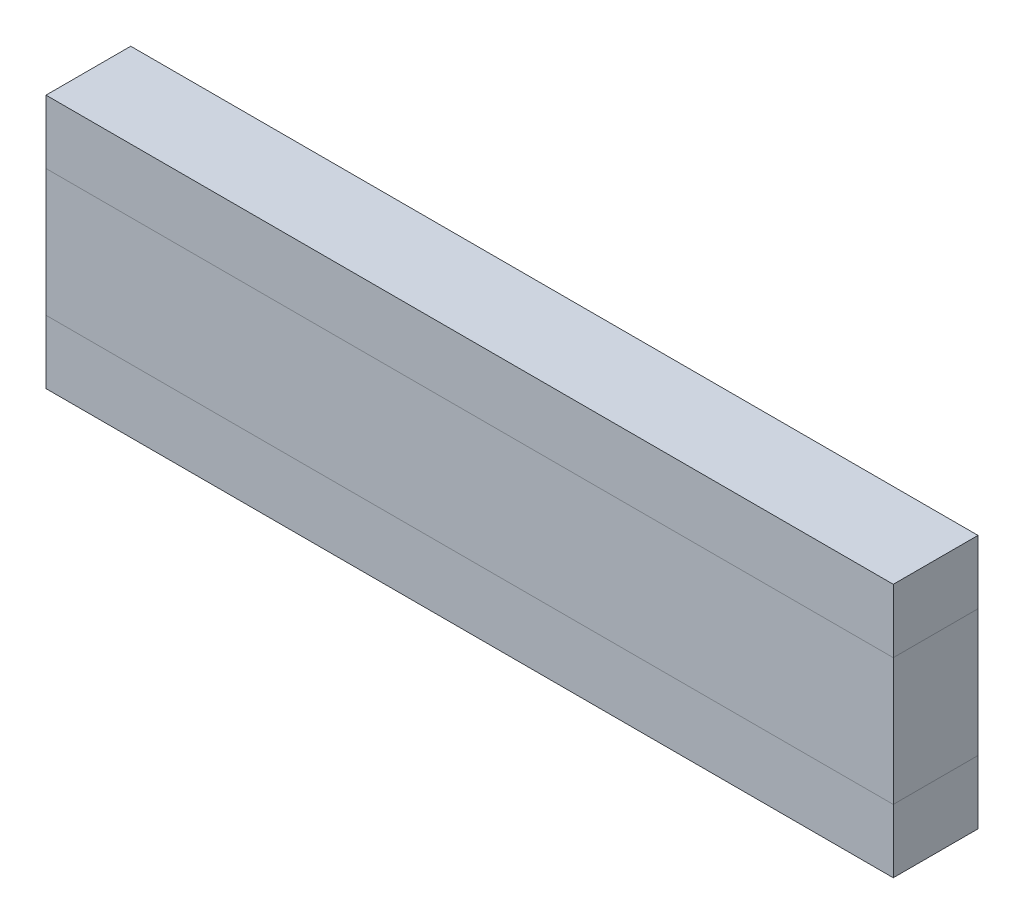
ISO-10303-21;
HEADER;
FILE_DESCRIPTION(('STEP AP214'),'2;1');
FILE_NAME('part.step','',(''),(''),'','','');
FILE_SCHEMA(('AUTOMOTIVE_DESIGN { 1 0 10303 214 1 1 1 1 }'));
ENDSEC;
DATA;
#1=APPLICATION_CONTEXT('core data for automotive mechanical design processes');
#2=APPLICATION_PROTOCOL_DEFINITION('international standard','automotive_design',2000,#1);
#3=PRODUCT_CONTEXT('',#1,'mechanical');
#4=PRODUCT('Part','Part','',(#3));
#5=PRODUCT_RELATED_PRODUCT_CATEGORY('part','',(#4));
#6=PRODUCT_DEFINITION_FORMATION('','',#4);
#7=PRODUCT_DEFINITION_CONTEXT('part definition',#1,'design');
#8=PRODUCT_DEFINITION('design','',#6,#7);
#9=PRODUCT_DEFINITION_SHAPE('','',#8);
#10=(LENGTH_UNIT() NAMED_UNIT(*) SI_UNIT(.MILLI.,.METRE.));
#11=(NAMED_UNIT(*) PLANE_ANGLE_UNIT() SI_UNIT($,.RADIAN.));
#12=(NAMED_UNIT(*) SI_UNIT($,.STERADIAN.) SOLID_ANGLE_UNIT());
#13=UNCERTAINTY_MEASURE_WITH_UNIT(LENGTH_MEASURE(1.E-05),#10,'distance_accuracy_value','');
#14=(GEOMETRIC_REPRESENTATION_CONTEXT(3) GLOBAL_UNCERTAINTY_ASSIGNED_CONTEXT((#13)) GLOBAL_UNIT_ASSIGNED_CONTEXT((#10,
#11,#12)) REPRESENTATION_CONTEXT('',''));
#15=CARTESIAN_POINT('',(0.,0.,0.));
#16=DIRECTION('',(0.,0.,1.));
#17=DIRECTION('',(1.,0.,0.));
#18=AXIS2_PLACEMENT_3D('',#15,#16,#17);
#19=CARTESIAN_POINT('',(-49.9999999999999,-7.49999999999999,105.280855600658));
#20=DIRECTION('',(1.,0.,0.));
#21=DIRECTION('',(0.,0.,-1.));
#22=AXIS2_PLACEMENT_3D('',#19,#20,#21);
#23=PLANE('',#22);
#24=DIRECTION('',(0.,-1.,0.));
#25=VECTOR('',#24,1.);
#26=CARTESIAN_POINT('',(-49.9999999999999,-7.49999999999999,5.));
#27=LINE('',#26,#25);
#28=CARTESIAN_POINT('',(-49.9999999999999,-7.49999999999999,5.));
#29=VERTEX_POINT('',#28);
#30=CARTESIAN_POINT('',(-49.9999999999999,-15.,5.));
#31=VERTEX_POINT('',#30);
#32=EDGE_CURVE('E116',#29,#31,#27,.T.);
#33=ORIENTED_EDGE('',*,*,#32,.F.);
#34=DIRECTION('',(0.,0.,-1.));
#35=VECTOR('',#34,1.);
#36=CARTESIAN_POINT('',(-49.9999999999999,-7.49999999999999,105.280855600658));
#37=LINE('',#36,#35);
#38=CARTESIAN_POINT('',(-49.9999999999999,-7.49999999999999,-5.));
#39=VERTEX_POINT('',#38);
#40=EDGE_CURVE('E54',#29,#39,#37,.T.);
#41=ORIENTED_EDGE('',*,*,#40,.T.);
#42=DIRECTION('',(0.,1.,0.));
#43=VECTOR('',#42,1.);
#44=CARTESIAN_POINT('',(-49.9999999999999,-7.49999999999999,-5.));
#45=LINE('',#44,#43);
#46=CARTESIAN_POINT('',(-49.9999999999999,-15.,-5.));
#47=VERTEX_POINT('',#46);
#48=EDGE_CURVE('E110',#47,#39,#45,.T.);
#49=ORIENTED_EDGE('',*,*,#48,.F.);
#50=DIRECTION('',(0.,0.,-1.));
#51=VECTOR('',#50,1.);
#52=CARTESIAN_POINT('',(-49.9999999999999,-15.,105.280855600658));
#53=LINE('',#52,#51);
#54=EDGE_CURVE('E99',#31,#47,#53,.T.);
#55=ORIENTED_EDGE('',*,*,#54,.F.);
#56=EDGE_LOOP('',(#33,#41,#49,#55));
#57=FACE_BOUND('',#56,.T.);
#58=ADVANCED_FACE('F50',(#57),#23,.F.);
#59=CARTESIAN_POINT('',(-49.9999999999999,-15.,105.280855600658));
#60=DIRECTION('',(0.,1.,0.));
#61=DIRECTION('',(0.,0.,1.));
#62=AXIS2_PLACEMENT_3D('',#59,#60,#61);
#63=PLANE('',#62);
#64=DIRECTION('',(1.,0.,0.));
#65=VECTOR('',#64,1.);
#66=CARTESIAN_POINT('',(-49.9999999999999,-15.,5.));
#67=LINE('',#66,#65);
#68=CARTESIAN_POINT('',(50.,-15.,5.));
#69=VERTEX_POINT('',#68);
#70=EDGE_CURVE('E59',#31,#69,#67,.T.);
#71=ORIENTED_EDGE('',*,*,#70,.F.);
#72=ORIENTED_EDGE('',*,*,#54,.T.);
#73=DIRECTION('',(-1.,0.,0.));
#74=VECTOR('',#73,1.);
#75=CARTESIAN_POINT('',(-49.9999999999999,-15.,-5.));
#76=LINE('',#75,#74);
#77=CARTESIAN_POINT('',(50.,-15.,-5.));
#78=VERTEX_POINT('',#77);
#79=EDGE_CURVE('E105',#78,#47,#76,.T.);
#80=ORIENTED_EDGE('',*,*,#79,.F.);
#81=DIRECTION('',(0.,0.,-1.));
#82=VECTOR('',#81,1.);
#83=CARTESIAN_POINT('',(50.,-15.,105.280855600658));
#84=LINE('',#83,#82);
#85=EDGE_CURVE('E94',#69,#78,#84,.T.);
#86=ORIENTED_EDGE('',*,*,#85,.F.);
#87=EDGE_LOOP('',(#71,#72,#80,#86));
#88=FACE_BOUND('',#87,.T.);
#89=ADVANCED_FACE('F109',(#88),#63,.F.);
#90=CARTESIAN_POINT('',(50.,-7.49999999999999,105.280855600658));
#91=DIRECTION('',(-1.,0.,0.));
#92=DIRECTION('',(0.,0.,1.));
#93=AXIS2_PLACEMENT_3D('',#90,#91,#92);
#94=PLANE('',#93);
#95=DIRECTION('',(0.,1.,0.));
#96=VECTOR('',#95,1.);
#97=CARTESIAN_POINT('',(50.,-7.49999999999999,5.));
#98=LINE('',#97,#96);
#99=CARTESIAN_POINT('',(50.,-7.49999999999999,5.));
#100=VERTEX_POINT('',#99);
#101=EDGE_CURVE('E12',#69,#100,#98,.T.);
#102=ORIENTED_EDGE('',*,*,#101,.F.);
#103=ORIENTED_EDGE('',*,*,#85,.T.);
#104=DIRECTION('',(0.,-1.,0.));
#105=VECTOR('',#104,1.);
#106=CARTESIAN_POINT('',(50.,-7.49999999999999,-5.));
#107=LINE('',#106,#105);
#108=CARTESIAN_POINT('',(50.,-7.49999999999999,-5.));
#109=VERTEX_POINT('',#108);
#110=EDGE_CURVE('E97',#109,#78,#107,.T.);
#111=ORIENTED_EDGE('',*,*,#110,.F.);
#112=DIRECTION('',(0.,0.,-1.));
#113=VECTOR('',#112,1.);
#114=CARTESIAN_POINT('',(50.,-7.49999999999999,105.280855600658));
#115=LINE('',#114,#113);
#116=EDGE_CURVE('E75',#100,#109,#115,.T.);
#117=ORIENTED_EDGE('',*,*,#116,.F.);
#118=EDGE_LOOP('',(#102,#103,#111,#117));
#119=FACE_BOUND('',#118,.T.);
#120=ADVANCED_FACE('F96',(#119),#94,.F.);
#121=CARTESIAN_POINT('',(-49.9999999999999,-7.49999999999999,105.280855600658));
#122=DIRECTION('',(0.,-1.,0.));
#123=DIRECTION('',(0.,0.,-1.));
#124=AXIS2_PLACEMENT_3D('',#121,#122,#123);
#125=PLANE('',#124);
#126=DIRECTION('',(-1.,0.,0.));
#127=VECTOR('',#126,1.);
#128=CARTESIAN_POINT('',(-49.9999999999999,-7.49999999999999,5.));
#129=LINE('',#128,#127);
#130=EDGE_CURVE('E119',#100,#29,#129,.T.);
#131=ORIENTED_EDGE('',*,*,#130,.F.);
#132=ORIENTED_EDGE('',*,*,#116,.T.);
#133=DIRECTION('',(1.,0.,0.));
#134=VECTOR('',#133,1.);
#135=CARTESIAN_POINT('',(-49.9999999999999,-7.49999999999999,-5.));
#136=LINE('',#135,#134);
#137=EDGE_CURVE('E107',#39,#109,#136,.T.);
#138=ORIENTED_EDGE('',*,*,#137,.F.);
#139=ORIENTED_EDGE('',*,*,#40,.F.);
#140=EDGE_LOOP('',(#131,#132,#138,#139));
#141=FACE_BOUND('',#140,.T.);
#142=ADVANCED_FACE('F123',(#141),#125,.F.);
#143=CARTESIAN_POINT('',(0.,0.,5.));
#144=DIRECTION('',(0.,0.,1.));
#145=DIRECTION('',(1.,0.,0.));
#146=AXIS2_PLACEMENT_3D('',#143,#144,#145);
#147=PLANE('',#146);
#148=ORIENTED_EDGE('',*,*,#130,.T.);
#149=ORIENTED_EDGE('',*,*,#32,.T.);
#150=ORIENTED_EDGE('',*,*,#70,.T.);
#151=ORIENTED_EDGE('',*,*,#101,.T.);
#152=EDGE_LOOP('',(#148,#149,#150,#151));
#153=FACE_BOUND('',#152,.T.);
#154=ADVANCED_FACE('F52',(#153),#147,.T.);
#155=CARTESIAN_POINT('',(0.,0.,-5.));
#156=DIRECTION('',(0.,0.,1.));
#157=DIRECTION('',(1.,0.,0.));
#158=AXIS2_PLACEMENT_3D('',#155,#156,#157);
#159=PLANE('',#158);
#160=ORIENTED_EDGE('',*,*,#48,.T.);
#161=ORIENTED_EDGE('',*,*,#137,.T.);
#162=ORIENTED_EDGE('',*,*,#110,.T.);
#163=ORIENTED_EDGE('',*,*,#79,.T.);
#164=EDGE_LOOP('',(#160,#161,#162,#163));
#165=FACE_BOUND('',#164,.T.);
#166=ADVANCED_FACE('F104',(#165),#159,.F.);
#167=CLOSED_SHELL('',(#58,#89,#120,#142,#154,#166));
#168=MANIFOLD_SOLID_BREP('B2',#167);
#169=CARTESIAN_POINT('',(-49.9999999999999,7.50000000000001,105.280855600658));
#170=DIRECTION('',(1.,0.,0.));
#171=DIRECTION('',(0.,0.,-1.));
#172=AXIS2_PLACEMENT_3D('',#169,#170,#171);
#173=PLANE('',#172);
#174=DIRECTION('',(0.,-1.,0.));
#175=VECTOR('',#174,1.);
#176=CARTESIAN_POINT('',(-49.9999999999999,7.50000000000001,5.));
#177=LINE('',#176,#175);
#178=CARTESIAN_POINT('',(-49.9999999999999,15.,5.));
#179=VERTEX_POINT('',#178);
#180=CARTESIAN_POINT('',(-49.9999999999999,7.50000000000001,5.));
#181=VERTEX_POINT('',#180);
#182=EDGE_CURVE('E249',#179,#181,#177,.T.);
#183=ORIENTED_EDGE('',*,*,#182,.F.);
#184=DIRECTION('',(0.,0.,-1.));
#185=VECTOR('',#184,1.);
#186=CARTESIAN_POINT('',(-49.9999999999999,15.,105.280855600658));
#187=LINE('',#186,#185);
#188=CARTESIAN_POINT('',(-49.9999999999999,15.,-5.));
#189=VERTEX_POINT('',#188);
#190=EDGE_CURVE('E187',#179,#189,#187,.T.);
#191=ORIENTED_EDGE('',*,*,#190,.T.);
#192=DIRECTION('',(0.,1.,0.));
#193=VECTOR('',#192,1.);
#194=CARTESIAN_POINT('',(-49.9999999999999,7.50000000000001,-5.));
#195=LINE('',#194,#193);
#196=CARTESIAN_POINT('',(-49.9999999999999,7.50000000000001,-5.));
#197=VERTEX_POINT('',#196);
#198=EDGE_CURVE('E243',#197,#189,#195,.T.);
#199=ORIENTED_EDGE('',*,*,#198,.F.);
#200=DIRECTION('',(0.,0.,-1.));
#201=VECTOR('',#200,1.);
#202=CARTESIAN_POINT('',(-49.9999999999999,7.50000000000001,105.280855600658));
#203=LINE('',#202,#201);
#204=EDGE_CURVE('E232',#181,#197,#203,.T.);
#205=ORIENTED_EDGE('',*,*,#204,.F.);
#206=EDGE_LOOP('',(#183,#191,#199,#205));
#207=FACE_BOUND('',#206,.T.);
#208=ADVANCED_FACE('F183',(#207),#173,.F.);
#209=CARTESIAN_POINT('',(-49.9999999999999,7.50000000000001,105.280855600658));
#210=DIRECTION('',(0.,1.,0.));
#211=DIRECTION('',(0.,0.,1.));
#212=AXIS2_PLACEMENT_3D('',#209,#210,#211);
#213=PLANE('',#212);
#214=DIRECTION('',(1.,0.,0.));
#215=VECTOR('',#214,1.);
#216=CARTESIAN_POINT('',(-49.9999999999999,7.50000000000001,5.));
#217=LINE('',#216,#215);
#218=CARTESIAN_POINT('',(50.,7.50000000000001,5.));
#219=VERTEX_POINT('',#218);
#220=EDGE_CURVE('E192',#181,#219,#217,.T.);
#221=ORIENTED_EDGE('',*,*,#220,.F.);
#222=ORIENTED_EDGE('',*,*,#204,.T.);
#223=DIRECTION('',(-1.,0.,0.));
#224=VECTOR('',#223,1.);
#225=CARTESIAN_POINT('',(-49.9999999999999,7.50000000000001,-5.));
#226=LINE('',#225,#224);
#227=CARTESIAN_POINT('',(50.,7.50000000000001,-5.));
#228=VERTEX_POINT('',#227);
#229=EDGE_CURVE('E238',#228,#197,#226,.T.);
#230=ORIENTED_EDGE('',*,*,#229,.F.);
#231=DIRECTION('',(0.,0.,-1.));
#232=VECTOR('',#231,1.);
#233=CARTESIAN_POINT('',(50.,7.50000000000001,105.280855600658));
#234=LINE('',#233,#232);
#235=EDGE_CURVE('E227',#219,#228,#234,.T.);
#236=ORIENTED_EDGE('',*,*,#235,.F.);
#237=EDGE_LOOP('',(#221,#222,#230,#236));
#238=FACE_BOUND('',#237,.T.);
#239=ADVANCED_FACE('F242',(#238),#213,.F.);
#240=CARTESIAN_POINT('',(50.,7.50000000000001,105.280855600658));
#241=DIRECTION('',(-1.,0.,0.));
#242=DIRECTION('',(0.,0.,1.));
#243=AXIS2_PLACEMENT_3D('',#240,#241,#242);
#244=PLANE('',#243);
#245=DIRECTION('',(0.,1.,0.));
#246=VECTOR('',#245,1.);
#247=CARTESIAN_POINT('',(50.,7.50000000000001,5.));
#248=LINE('',#247,#246);
#249=CARTESIAN_POINT('',(50.,15.,5.));
#250=VERTEX_POINT('',#249);
#251=EDGE_CURVE('E48',#219,#250,#248,.T.);
#252=ORIENTED_EDGE('',*,*,#251,.F.);
#253=ORIENTED_EDGE('',*,*,#235,.T.);
#254=DIRECTION('',(0.,-1.,0.));
#255=VECTOR('',#254,1.);
#256=CARTESIAN_POINT('',(50.,7.50000000000001,-5.));
#257=LINE('',#256,#255);
#258=CARTESIAN_POINT('',(50.,15.,-5.));
#259=VERTEX_POINT('',#258);
#260=EDGE_CURVE('E230',#259,#228,#257,.T.);
#261=ORIENTED_EDGE('',*,*,#260,.F.);
#262=DIRECTION('',(0.,0.,-1.));
#263=VECTOR('',#262,1.);
#264=CARTESIAN_POINT('',(50.,15.,105.280855600658));
#265=LINE('',#264,#263);
#266=EDGE_CURVE('E208',#250,#259,#265,.T.);
#267=ORIENTED_EDGE('',*,*,#266,.F.);
#268=EDGE_LOOP('',(#252,#253,#261,#267));
#269=FACE_BOUND('',#268,.T.);
#270=ADVANCED_FACE('F229',(#269),#244,.F.);
#271=CARTESIAN_POINT('',(-49.9999999999999,15.,105.280855600658));
#272=DIRECTION('',(0.,-1.,0.));
#273=DIRECTION('',(0.,0.,-1.));
#274=AXIS2_PLACEMENT_3D('',#271,#272,#273);
#275=PLANE('',#274);
#276=DIRECTION('',(-1.,0.,0.));
#277=VECTOR('',#276,1.);
#278=CARTESIAN_POINT('',(-49.9999999999999,15.,5.));
#279=LINE('',#278,#277);
#280=EDGE_CURVE('E252',#250,#179,#279,.T.);
#281=ORIENTED_EDGE('',*,*,#280,.F.);
#282=ORIENTED_EDGE('',*,*,#266,.T.);
#283=DIRECTION('',(1.,0.,0.));
#284=VECTOR('',#283,1.);
#285=CARTESIAN_POINT('',(-49.9999999999999,15.,-5.));
#286=LINE('',#285,#284);
#287=EDGE_CURVE('E240',#189,#259,#286,.T.);
#288=ORIENTED_EDGE('',*,*,#287,.F.);
#289=ORIENTED_EDGE('',*,*,#190,.F.);
#290=EDGE_LOOP('',(#281,#282,#288,#289));
#291=FACE_BOUND('',#290,.T.);
#292=ADVANCED_FACE('F256',(#291),#275,.F.);
#293=CARTESIAN_POINT('',(0.,0.,5.));
#294=DIRECTION('',(0.,0.,1.));
#295=DIRECTION('',(1.,0.,0.));
#296=AXIS2_PLACEMENT_3D('',#293,#294,#295);
#297=PLANE('',#296);
#298=ORIENTED_EDGE('',*,*,#280,.T.);
#299=ORIENTED_EDGE('',*,*,#182,.T.);
#300=ORIENTED_EDGE('',*,*,#220,.T.);
#301=ORIENTED_EDGE('',*,*,#251,.T.);
#302=EDGE_LOOP('',(#298,#299,#300,#301));
#303=FACE_BOUND('',#302,.T.);
#304=ADVANCED_FACE('F185',(#303),#297,.T.);
#305=CARTESIAN_POINT('',(0.,0.,-5.));
#306=DIRECTION('',(0.,0.,1.));
#307=DIRECTION('',(1.,0.,0.));
#308=AXIS2_PLACEMENT_3D('',#305,#306,#307);
#309=PLANE('',#308);
#310=ORIENTED_EDGE('',*,*,#198,.T.);
#311=ORIENTED_EDGE('',*,*,#287,.T.);
#312=ORIENTED_EDGE('',*,*,#260,.T.);
#313=ORIENTED_EDGE('',*,*,#229,.T.);
#314=EDGE_LOOP('',(#310,#311,#312,#313));
#315=FACE_BOUND('',#314,.T.);
#316=ADVANCED_FACE('F237',(#315),#309,.F.);
#317=CLOSED_SHELL('',(#208,#239,#270,#292,#304,#316));
#318=MANIFOLD_SOLID_BREP('B6',#317);
#319=CARTESIAN_POINT('',(50.,7.50000000000001,5.));
#320=DIRECTION('',(-1.,0.,0.));
#321=DIRECTION('',(0.,0.,1.));
#322=AXIS2_PLACEMENT_3D('',#319,#320,#321);
#323=PLANE('',#322);
#324=DIRECTION('',(0.,1.,0.));
#325=VECTOR('',#324,1.);
#326=CARTESIAN_POINT('',(50.,7.50000000000001,-5.));
#327=LINE('',#326,#325);
#328=CARTESIAN_POINT('',(50.,-7.49999999999999,-5.));
#329=VERTEX_POINT('',#328);
#330=CARTESIAN_POINT('',(50.,7.50000000000001,-5.));
#331=VERTEX_POINT('',#330);
#332=EDGE_CURVE('E370',#329,#331,#327,.T.);
#333=ORIENTED_EDGE('',*,*,#332,.T.);
#334=DIRECTION('',(0.,0.,-1.));
#335=VECTOR('',#334,1.);
#336=CARTESIAN_POINT('',(50.,7.50000000000001,5.));
#337=LINE('',#336,#335);
#338=CARTESIAN_POINT('',(50.,7.50000000000001,5.));
#339=VERTEX_POINT('',#338);
#340=EDGE_CURVE('E181',#339,#331,#337,.T.);
#341=ORIENTED_EDGE('',*,*,#340,.F.);
#342=DIRECTION('',(0.,1.,0.));
#343=VECTOR('',#342,1.);
#344=CARTESIAN_POINT('',(50.,7.50000000000001,5.));
#345=LINE('',#344,#343);
#346=CARTESIAN_POINT('',(50.,-7.49999999999999,5.));
#347=VERTEX_POINT('',#346);
#348=EDGE_CURVE('E358',#347,#339,#345,.T.);
#349=ORIENTED_EDGE('',*,*,#348,.F.);
#350=DIRECTION('',(0.,0.,-1.));
#351=VECTOR('',#350,1.);
#352=CARTESIAN_POINT('',(50.,-7.49999999999999,5.));
#353=LINE('',#352,#351);
#354=EDGE_CURVE('E366',#347,#329,#353,.T.);
#355=ORIENTED_EDGE('',*,*,#354,.T.);
#356=EDGE_LOOP('',(#333,#341,#349,#355));
#357=FACE_BOUND('',#356,.T.);
#358=ADVANCED_FACE('F307',(#357),#323,.F.);
#359=CARTESIAN_POINT('',(-49.9999999999999,7.50000000000001,5.));
#360=DIRECTION('',(0.,-1.,0.));
#361=DIRECTION('',(0.,0.,-1.));
#362=AXIS2_PLACEMENT_3D('',#359,#360,#361);
#363=PLANE('',#362);
#364=DIRECTION('',(-1.,0.,0.));
#365=VECTOR('',#364,1.);
#366=CARTESIAN_POINT('',(-49.9999999999999,7.50000000000001,-5.));
#367=LINE('',#366,#365);
#368=CARTESIAN_POINT('',(-49.9999999999999,7.50000000000001,-5.));
#369=VERTEX_POINT('',#368);
#370=EDGE_CURVE('E362',#331,#369,#367,.T.);
#371=ORIENTED_EDGE('',*,*,#370,.T.);
#372=DIRECTION('',(0.,0.,-1.));
#373=VECTOR('',#372,1.);
#374=CARTESIAN_POINT('',(-49.9999999999999,7.50000000000001,5.));
#375=LINE('',#374,#373);
#376=CARTESIAN_POINT('',(-49.9999999999999,7.50000000000001,5.));
#377=VERTEX_POINT('',#376);
#378=EDGE_CURVE('E315',#377,#369,#375,.T.);
#379=ORIENTED_EDGE('',*,*,#378,.F.);
#380=DIRECTION('',(-1.,0.,0.));
#381=VECTOR('',#380,1.);
#382=CARTESIAN_POINT('',(-49.9999999999999,7.50000000000001,5.));
#383=LINE('',#382,#381);
#384=EDGE_CURVE('E353',#339,#377,#383,.T.);
#385=ORIENTED_EDGE('',*,*,#384,.F.);
#386=ORIENTED_EDGE('',*,*,#340,.T.);
#387=EDGE_LOOP('',(#371,#379,#385,#386));
#388=FACE_BOUND('',#387,.T.);
#389=ADVANCED_FACE('F361',(#388),#363,.F.);
#390=CARTESIAN_POINT('',(-49.9999999999999,7.50000000000001,5.));
#391=DIRECTION('',(1.,0.,0.));
#392=DIRECTION('',(0.,0.,-1.));
#393=AXIS2_PLACEMENT_3D('',#390,#391,#392);
#394=PLANE('',#393);
#395=DIRECTION('',(0.,-1.,0.));
#396=VECTOR('',#395,1.);
#397=CARTESIAN_POINT('',(-49.9999999999999,7.50000000000001,-5.));
#398=LINE('',#397,#396);
#399=CARTESIAN_POINT('',(-49.9999999999999,-7.49999999999999,-5.));
#400=VERTEX_POINT('',#399);
#401=EDGE_CURVE('E340',#369,#400,#398,.T.);
#402=ORIENTED_EDGE('',*,*,#401,.T.);
#403=DIRECTION('',(0.,0.,-1.));
#404=VECTOR('',#403,1.);
#405=CARTESIAN_POINT('',(-49.9999999999999,-7.49999999999999,5.));
#406=LINE('',#405,#404);
#407=CARTESIAN_POINT('',(-49.9999999999999,-7.49999999999999,5.));
#408=VERTEX_POINT('',#407);
#409=EDGE_CURVE('E363',#408,#400,#406,.T.);
#410=ORIENTED_EDGE('',*,*,#409,.F.);
#411=DIRECTION('',(0.,-1.,0.));
#412=VECTOR('',#411,1.);
#413=CARTESIAN_POINT('',(-49.9999999999999,7.50000000000001,5.));
#414=LINE('',#413,#412);
#415=EDGE_CURVE('E356',#377,#408,#414,.T.);
#416=ORIENTED_EDGE('',*,*,#415,.F.);
#417=ORIENTED_EDGE('',*,*,#378,.T.);
#418=EDGE_LOOP('',(#402,#410,#416,#417));
#419=FACE_BOUND('',#418,.T.);
#420=ADVANCED_FACE('F364',(#419),#394,.F.);
#421=CARTESIAN_POINT('',(-49.9999999999999,-7.49999999999999,5.));
#422=DIRECTION('',(0.,1.,0.));
#423=DIRECTION('',(0.,0.,1.));
#424=AXIS2_PLACEMENT_3D('',#421,#422,#423);
#425=PLANE('',#424);
#426=DIRECTION('',(1.,0.,0.));
#427=VECTOR('',#426,1.);
#428=CARTESIAN_POINT('',(-49.9999999999999,-7.49999999999999,-5.));
#429=LINE('',#428,#427);
#430=EDGE_CURVE('E346',#400,#329,#429,.T.);
#431=ORIENTED_EDGE('',*,*,#430,.T.);
#432=ORIENTED_EDGE('',*,*,#354,.F.);
#433=DIRECTION('',(1.,0.,0.));
#434=VECTOR('',#433,1.);
#435=CARTESIAN_POINT('',(-49.9999999999999,-7.49999999999999,5.));
#436=LINE('',#435,#434);
#437=EDGE_CURVE('E323',#408,#347,#436,.T.);
#438=ORIENTED_EDGE('',*,*,#437,.F.);
#439=ORIENTED_EDGE('',*,*,#409,.T.);
#440=EDGE_LOOP('',(#431,#432,#438,#439));
#441=FACE_BOUND('',#440,.T.);
#442=ADVANCED_FACE('F377',(#441),#425,.F.);
#443=CARTESIAN_POINT('',(0.,0.,5.));
#444=DIRECTION('',(0.,0.,1.));
#445=DIRECTION('',(1.,0.,0.));
#446=AXIS2_PLACEMENT_3D('',#443,#444,#445);
#447=PLANE('',#446);
#448=ORIENTED_EDGE('',*,*,#348,.T.);
#449=ORIENTED_EDGE('',*,*,#384,.T.);
#450=ORIENTED_EDGE('',*,*,#415,.T.);
#451=ORIENTED_EDGE('',*,*,#437,.T.);
#452=EDGE_LOOP('',(#448,#449,#450,#451));
#453=FACE_BOUND('',#452,.T.);
#454=ADVANCED_FACE('F354',(#453),#447,.T.);
#455=CARTESIAN_POINT('',(0.,0.,-5.));
#456=DIRECTION('',(0.,0.,1.));
#457=DIRECTION('',(1.,0.,0.));
#458=AXIS2_PLACEMENT_3D('',#455,#456,#457);
#459=PLANE('',#458);
#460=ORIENTED_EDGE('',*,*,#332,.F.);
#461=ORIENTED_EDGE('',*,*,#430,.F.);
#462=ORIENTED_EDGE('',*,*,#401,.F.);
#463=ORIENTED_EDGE('',*,*,#370,.F.);
#464=EDGE_LOOP('',(#460,#461,#462,#463));
#465=FACE_BOUND('',#464,.T.);
#466=ADVANCED_FACE('F380',(#465),#459,.F.);
#467=CLOSED_SHELL('',(#358,#389,#420,#442,#454,#466));
#468=MANIFOLD_SOLID_BREP('B42',#467);
#469=ADVANCED_BREP_SHAPE_REPRESENTATION('',(#18,#168,#318,#468),#14);
#470=SHAPE_DEFINITION_REPRESENTATION(#9,#469);
ENDSEC;
END-ISO-10303-21;
